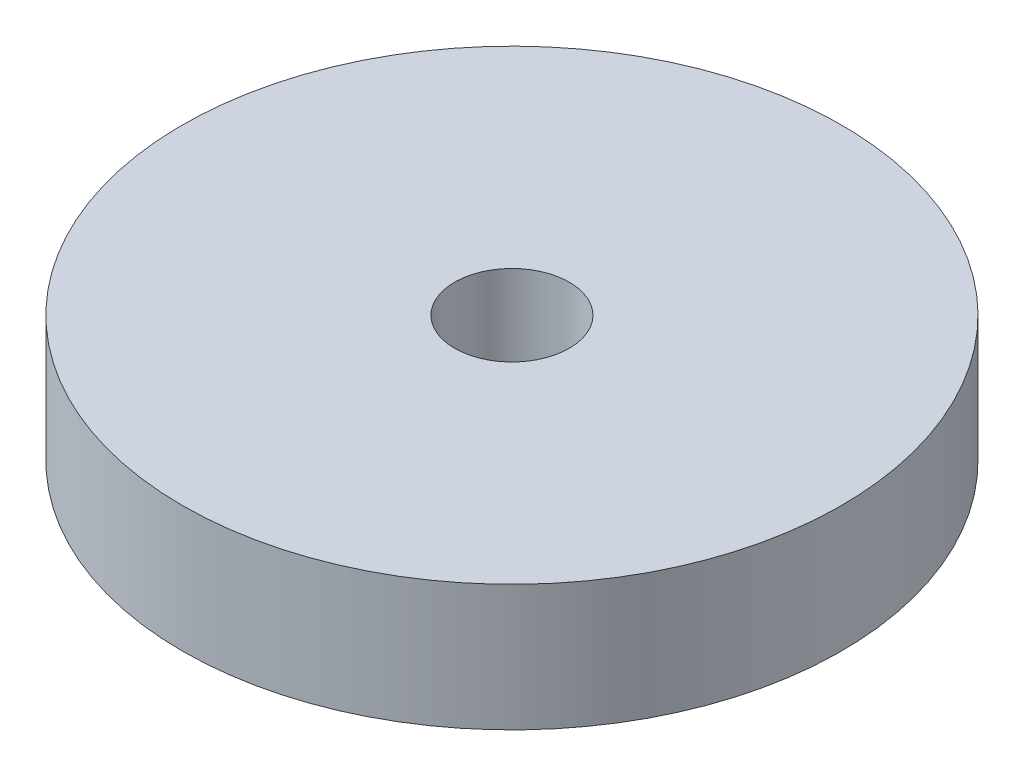
ISO-10303-21;
HEADER;
FILE_DESCRIPTION(('STEP AP214'),'2;1');
FILE_NAME('part.step','',(''),(''),'','','');
FILE_SCHEMA(('AUTOMOTIVE_DESIGN { 1 0 10303 214 1 1 1 1 }'));
ENDSEC;
DATA;
#1=APPLICATION_CONTEXT('core data for automotive mechanical design processes');
#2=APPLICATION_PROTOCOL_DEFINITION('international standard','automotive_design',2000,#1);
#3=PRODUCT_CONTEXT('',#1,'mechanical');
#4=PRODUCT('Part','Part','',(#3));
#5=PRODUCT_RELATED_PRODUCT_CATEGORY('part','',(#4));
#6=PRODUCT_DEFINITION_FORMATION('','',#4);
#7=PRODUCT_DEFINITION_CONTEXT('part definition',#1,'design');
#8=PRODUCT_DEFINITION('design','',#6,#7);
#9=PRODUCT_DEFINITION_SHAPE('','',#8);
#10=(LENGTH_UNIT() NAMED_UNIT(*) SI_UNIT(.MILLI.,.METRE.));
#11=(NAMED_UNIT(*) PLANE_ANGLE_UNIT() SI_UNIT($,.RADIAN.));
#12=(NAMED_UNIT(*) SI_UNIT($,.STERADIAN.) SOLID_ANGLE_UNIT());
#13=UNCERTAINTY_MEASURE_WITH_UNIT(LENGTH_MEASURE(1.E-05),#10,'distance_accuracy_value','');
#14=(GEOMETRIC_REPRESENTATION_CONTEXT(3) GLOBAL_UNCERTAINTY_ASSIGNED_CONTEXT((#13)) GLOBAL_UNIT_ASSIGNED_CONTEXT((#10,
#11,#12)) REPRESENTATION_CONTEXT('',''));
#15=CARTESIAN_POINT('',(0.,0.,0.));
#16=DIRECTION('',(0.,0.,1.));
#17=DIRECTION('',(1.,0.,0.));
#18=AXIS2_PLACEMENT_3D('',#15,#16,#17);
#19=CARTESIAN_POINT('',(0.,22.,0.));
#20=DIRECTION('',(0.,-1.,0.));
#21=DIRECTION('',(0.,0.,-1.));
#22=AXIS2_PLACEMENT_3D('',#19,#20,#21);
#23=CYLINDRICAL_SURFACE('',#22,57.5);
#24=CARTESIAN_POINT('',(0.,22.,0.));
#25=DIRECTION('',(0.,1.,0.));
#26=DIRECTION('',(0.,0.,1.));
#27=AXIS2_PLACEMENT_3D('',#24,#25,#26);
#28=CIRCLE('',#27,57.5);
#29=CARTESIAN_POINT('',(0.,22.,57.5));
#30=VERTEX_POINT('',#29);
#31=EDGE_CURVE('E10',#30,#30,#28,.T.);
#32=ORIENTED_EDGE('',*,*,#31,.F.);
#33=EDGE_LOOP('',(#32));
#34=FACE_BOUND('',#33,.T.);
#35=CARTESIAN_POINT('',(0.,0.,0.));
#36=DIRECTION('',(0.,1.,0.));
#37=DIRECTION('',(0.,0.,1.));
#38=AXIS2_PLACEMENT_3D('',#35,#36,#37);
#39=CIRCLE('',#38,57.5);
#40=CARTESIAN_POINT('',(0.,0.,57.5));
#41=VERTEX_POINT('',#40);
#42=EDGE_CURVE('E37',#41,#41,#39,.T.);
#43=ORIENTED_EDGE('',*,*,#42,.T.);
#44=EDGE_LOOP('',(#43));
#45=FACE_BOUND('',#44,.T.);
#46=ADVANCED_FACE('F40',(#34,#45),#23,.T.);
#47=CARTESIAN_POINT('',(0.,22.,0.));
#48=DIRECTION('',(0.,1.,0.));
#49=DIRECTION('',(0.,0.,1.));
#50=AXIS2_PLACEMENT_3D('',#47,#48,#49);
#51=PLANE('',#50);
#52=CARTESIAN_POINT('',(0.,22.,0.));
#53=DIRECTION('',(0.,1.,0.));
#54=DIRECTION('',(0.,0.,1.));
#55=AXIS2_PLACEMENT_3D('',#52,#53,#54);
#56=CIRCLE('',#55,10.);
#57=CARTESIAN_POINT('',(0.,22.,10.));
#58=VERTEX_POINT('',#57);
#59=EDGE_CURVE('E50',#58,#58,#56,.T.);
#60=ORIENTED_EDGE('',*,*,#59,.F.);
#61=EDGE_LOOP('',(#60));
#62=FACE_BOUND('',#61,.T.);
#63=ORIENTED_EDGE('',*,*,#31,.T.);
#64=EDGE_LOOP('',(#63));
#65=FACE_BOUND('',#64,.T.);
#66=ADVANCED_FACE('F59',(#62,#65),#51,.T.);
#67=CARTESIAN_POINT('',(0.,0.,0.));
#68=DIRECTION('',(0.,1.,0.));
#69=DIRECTION('',(0.,0.,1.));
#70=AXIS2_PLACEMENT_3D('',#67,#68,#69);
#71=PLANE('',#70);
#72=CARTESIAN_POINT('',(0.,0.,0.));
#73=DIRECTION('',(0.,1.,0.));
#74=DIRECTION('',(0.,0.,1.));
#75=AXIS2_PLACEMENT_3D('',#72,#73,#74);
#76=CIRCLE('',#75,10.);
#77=CARTESIAN_POINT('',(0.,0.,10.));
#78=VERTEX_POINT('',#77);
#79=EDGE_CURVE('E47',#78,#78,#76,.T.);
#80=ORIENTED_EDGE('',*,*,#79,.T.);
#81=EDGE_LOOP('',(#80));
#82=FACE_BOUND('',#81,.T.);
#83=ORIENTED_EDGE('',*,*,#42,.F.);
#84=EDGE_LOOP('',(#83));
#85=FACE_BOUND('',#84,.T.);
#86=ADVANCED_FACE('F58',(#82,#85),#71,.F.);
#87=CARTESIAN_POINT('',(0.,22.,0.));
#88=DIRECTION('',(0.,-1.,0.));
#89=DIRECTION('',(0.,0.,-1.));
#90=AXIS2_PLACEMENT_3D('',#87,#88,#89);
#91=CYLINDRICAL_SURFACE('',#90,10.);
#92=ORIENTED_EDGE('',*,*,#59,.T.);
#93=EDGE_LOOP('',(#92));
#94=FACE_BOUND('',#93,.T.);
#95=ORIENTED_EDGE('',*,*,#79,.F.);
#96=EDGE_LOOP('',(#95));
#97=FACE_BOUND('',#96,.T.);
#98=ADVANCED_FACE('F54',(#94,#97),#91,.F.);
#99=CLOSED_SHELL('',(#46,#66,#86,#98));
#100=MANIFOLD_SOLID_BREP('B2',#99);
#101=ADVANCED_BREP_SHAPE_REPRESENTATION('',(#18,#100),#14);
#102=SHAPE_DEFINITION_REPRESENTATION(#9,#101);
ENDSEC;
END-ISO-10303-21;
